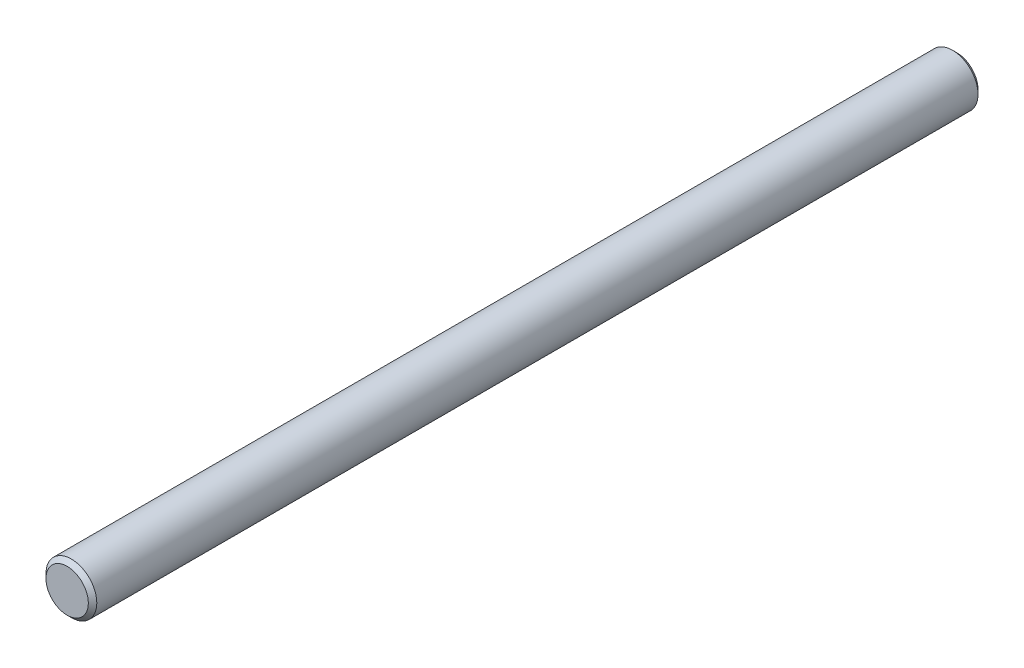
ISO-10303-21;
HEADER;
FILE_DESCRIPTION(('STEP AP214'),'2;1');
FILE_NAME('part.step','',(''),(''),'','','');
FILE_SCHEMA(('AUTOMOTIVE_DESIGN { 1 0 10303 214 1 1 1 1 }'));
ENDSEC;
DATA;
#1=APPLICATION_CONTEXT('core data for automotive mechanical design processes');
#2=APPLICATION_PROTOCOL_DEFINITION('international standard','automotive_design',2000,#1);
#3=PRODUCT_CONTEXT('',#1,'mechanical');
#4=PRODUCT('Part','Part','',(#3));
#5=PRODUCT_RELATED_PRODUCT_CATEGORY('part','',(#4));
#6=PRODUCT_DEFINITION_FORMATION('','',#4);
#7=PRODUCT_DEFINITION_CONTEXT('part definition',#1,'design');
#8=PRODUCT_DEFINITION('design','',#6,#7);
#9=PRODUCT_DEFINITION_SHAPE('','',#8);
#10=(LENGTH_UNIT() NAMED_UNIT(*) SI_UNIT(.MILLI.,.METRE.));
#11=(NAMED_UNIT(*) PLANE_ANGLE_UNIT() SI_UNIT($,.RADIAN.));
#12=(NAMED_UNIT(*) SI_UNIT($,.STERADIAN.) SOLID_ANGLE_UNIT());
#13=UNCERTAINTY_MEASURE_WITH_UNIT(LENGTH_MEASURE(1.E-05),#10,'distance_accuracy_value','');
#14=(GEOMETRIC_REPRESENTATION_CONTEXT(3) GLOBAL_UNCERTAINTY_ASSIGNED_CONTEXT((#13)) GLOBAL_UNIT_ASSIGNED_CONTEXT((#10,
#11,#12)) REPRESENTATION_CONTEXT('',''));
#15=CARTESIAN_POINT('',(0.,0.,0.));
#16=DIRECTION('',(0.,0.,1.));
#17=DIRECTION('',(1.,0.,0.));
#18=AXIS2_PLACEMENT_3D('',#15,#16,#17);
#19=CARTESIAN_POINT('',(0.,0.,210.));
#20=DIRECTION('',(0.,0.,-1.));
#21=DIRECTION('',(-1.,0.,0.));
#22=AXIS2_PLACEMENT_3D('',#19,#20,#21);
#23=CYLINDRICAL_SURFACE('',#22,6.);
#24=CARTESIAN_POINT('',(0.,0.,0.999999999999973));
#25=DIRECTION('',(0.,0.,1.));
#26=DIRECTION('',(1.,0.,0.));
#27=AXIS2_PLACEMENT_3D('',#24,#25,#26);
#28=CIRCLE('',#27,6.);
#29=CARTESIAN_POINT('',(6.,0.,0.999999999999973));
#30=VERTEX_POINT('',#29);
#31=EDGE_CURVE('E58',#30,#30,#28,.T.);
#32=ORIENTED_EDGE('',*,*,#31,.T.);
#33=EDGE_LOOP('',(#32));
#34=FACE_BOUND('',#33,.T.);
#35=CARTESIAN_POINT('',(0.,0.,209.));
#36=DIRECTION('',(0.,0.,1.));
#37=DIRECTION('',(1.,0.,0.));
#38=AXIS2_PLACEMENT_3D('',#35,#36,#37);
#39=CIRCLE('',#38,6.);
#40=CARTESIAN_POINT('',(6.,0.,209.));
#41=VERTEX_POINT('',#40);
#42=EDGE_CURVE('E62',#41,#41,#39,.F.);
#43=ORIENTED_EDGE('',*,*,#42,.T.);
#44=EDGE_LOOP('',(#43));
#45=FACE_BOUND('',#44,.T.);
#46=ADVANCED_FACE('F47',(#34,#45),#23,.T.);
#47=CARTESIAN_POINT('',(0.,0.,210.));
#48=DIRECTION('',(0.,0.,1.));
#49=DIRECTION('',(1.,0.,0.));
#50=AXIS2_PLACEMENT_3D('',#47,#48,#49);
#51=PLANE('',#50);
#52=CARTESIAN_POINT('',(0.,0.,210.));
#53=DIRECTION('',(0.,0.,1.));
#54=DIRECTION('',(1.,0.,0.));
#55=AXIS2_PLACEMENT_3D('',#52,#53,#54);
#56=CIRCLE('',#55,4.99999999999998);
#57=CARTESIAN_POINT('',(4.99999999999998,0.,210.));
#58=VERTEX_POINT('',#57);
#59=EDGE_CURVE('E12',#58,#58,#56,.T.);
#60=ORIENTED_EDGE('',*,*,#59,.T.);
#61=EDGE_LOOP('',(#60));
#62=FACE_BOUND('',#61,.T.);
#63=ADVANCED_FACE('F78',(#62),#51,.T.);
#64=CARTESIAN_POINT('',(0.,0.,0.));
#65=DIRECTION('',(0.,0.,1.));
#66=DIRECTION('',(1.,0.,0.));
#67=AXIS2_PLACEMENT_3D('',#64,#65,#66);
#68=PLANE('',#67);
#69=CARTESIAN_POINT('',(0.,0.,0.));
#70=DIRECTION('',(0.,0.,1.));
#71=DIRECTION('',(1.,0.,0.));
#72=AXIS2_PLACEMENT_3D('',#69,#70,#71);
#73=CIRCLE('',#72,5.00000000000003);
#74=CARTESIAN_POINT('',(5.00000000000003,0.,0.));
#75=VERTEX_POINT('',#74);
#76=EDGE_CURVE('E54',#75,#75,#73,.F.);
#77=ORIENTED_EDGE('',*,*,#76,.T.);
#78=EDGE_LOOP('',(#77));
#79=FACE_BOUND('',#78,.T.);
#80=ADVANCED_FACE('F75',(#79),#68,.F.);
#81=CARTESIAN_POINT('',(0.,0.,0.999999999999973));
#82=DIRECTION('',(0.,0.,1.));
#83=DIRECTION('',(1.,0.,0.));
#84=AXIS2_PLACEMENT_3D('',#81,#82,#83);
#85=CONICAL_SURFACE('',#84,6.,0.785398163397445);
#86=ORIENTED_EDGE('',*,*,#76,.F.);
#87=EDGE_LOOP('',(#86));
#88=FACE_BOUND('',#87,.T.);
#89=ORIENTED_EDGE('',*,*,#31,.F.);
#90=EDGE_LOOP('',(#89));
#91=FACE_BOUND('',#90,.T.);
#92=ADVANCED_FACE('F71',(#88,#91),#85,.T.);
#93=CARTESIAN_POINT('',(0.,0.,210.));
#94=DIRECTION('',(0.,0.,-1.));
#95=DIRECTION('',(-1.,0.,0.));
#96=AXIS2_PLACEMENT_3D('',#93,#94,#95);
#97=CONICAL_SURFACE('',#96,4.99999999999998,0.785398163397459);
#98=ORIENTED_EDGE('',*,*,#42,.F.);
#99=EDGE_LOOP('',(#98));
#100=FACE_BOUND('',#99,.T.);
#101=ORIENTED_EDGE('',*,*,#59,.F.);
#102=EDGE_LOOP('',(#101));
#103=FACE_BOUND('',#102,.T.);
#104=ADVANCED_FACE('F49',(#100,#103),#97,.T.);
#105=CLOSED_SHELL('',(#46,#63,#80,#92,#104));
#106=MANIFOLD_SOLID_BREP('B2',#105);
#107=ADVANCED_BREP_SHAPE_REPRESENTATION('',(#18,#106),#14);
#108=SHAPE_DEFINITION_REPRESENTATION(#9,#107);
ENDSEC;
END-ISO-10303-21;
